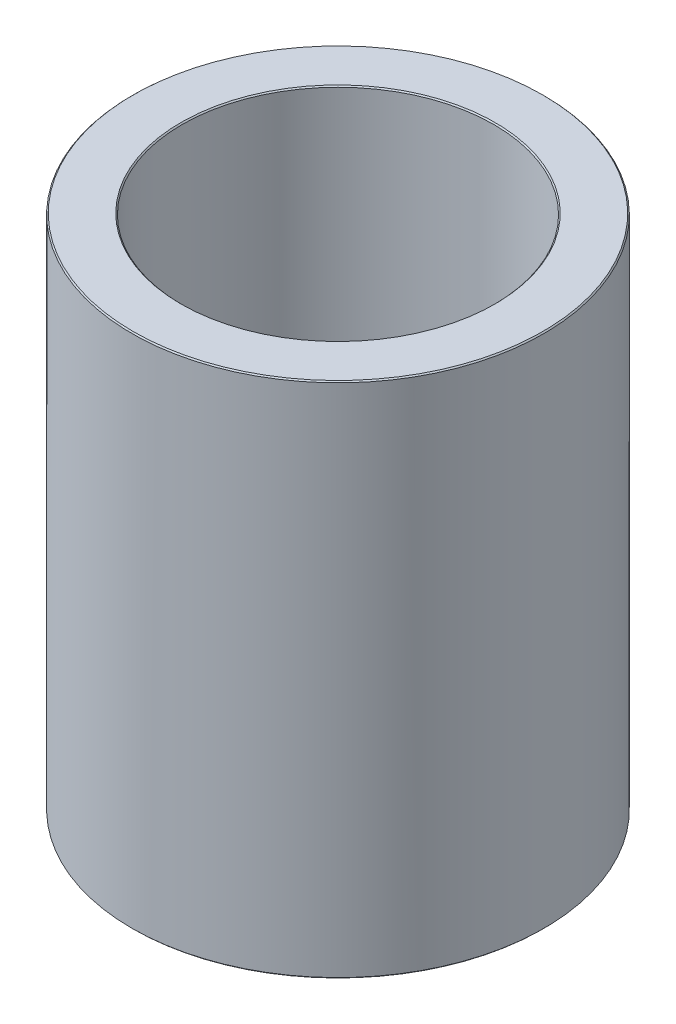
ISO-10303-21;
HEADER;
FILE_DESCRIPTION(('STEP AP214'),'2;1');
FILE_NAME('part.step','',(''),(''),'','','');
FILE_SCHEMA(('AUTOMOTIVE_DESIGN { 1 0 10303 214 1 1 1 1 }'));
ENDSEC;
DATA;
#1=APPLICATION_CONTEXT('core data for automotive mechanical design processes');
#2=APPLICATION_PROTOCOL_DEFINITION('international standard','automotive_design',2000,#1);
#3=PRODUCT_CONTEXT('',#1,'mechanical');
#4=PRODUCT('Part','Part','',(#3));
#5=PRODUCT_RELATED_PRODUCT_CATEGORY('part','',(#4));
#6=PRODUCT_DEFINITION_FORMATION('','',#4);
#7=PRODUCT_DEFINITION_CONTEXT('part definition',#1,'design');
#8=PRODUCT_DEFINITION('design','',#6,#7);
#9=PRODUCT_DEFINITION_SHAPE('','',#8);
#10=(LENGTH_UNIT() NAMED_UNIT(*) SI_UNIT(.MILLI.,.METRE.));
#11=(NAMED_UNIT(*) PLANE_ANGLE_UNIT() SI_UNIT($,.RADIAN.));
#12=(NAMED_UNIT(*) SI_UNIT($,.STERADIAN.) SOLID_ANGLE_UNIT());
#13=UNCERTAINTY_MEASURE_WITH_UNIT(LENGTH_MEASURE(1.E-05),#10,'distance_accuracy_value','');
#14=(GEOMETRIC_REPRESENTATION_CONTEXT(3) GLOBAL_UNCERTAINTY_ASSIGNED_CONTEXT((#13)) GLOBAL_UNIT_ASSIGNED_CONTEXT((#10,
#11,#12)) REPRESENTATION_CONTEXT('',''));
#15=CARTESIAN_POINT('',(0.,0.,0.));
#16=DIRECTION('',(0.,0.,1.));
#17=DIRECTION('',(1.,0.,0.));
#18=AXIS2_PLACEMENT_3D('',#15,#16,#17);
#19=CARTESIAN_POINT('',(0.,113.019225057278,0.));
#20=DIRECTION('',(0.,-1.,0.));
#21=DIRECTION('',(0.,0.,-1.));
#22=AXIS2_PLACEMENT_3D('',#19,#20,#21);
#23=CYLINDRICAL_SURFACE('',#22,45.);
#24=CARTESIAN_POINT('',(0.,0.255956402236898,0.));
#25=DIRECTION('',(0.,1.,0.));
#26=DIRECTION('',(0.,0.,1.));
#27=AXIS2_PLACEMENT_3D('',#24,#25,#26);
#28=CIRCLE('',#27,45.);
#29=CARTESIAN_POINT('',(0.,0.255956402236898,-45.));
#30=VERTEX_POINT('',#29);
#31=EDGE_CURVE('E10',#30,#30,#28,.T.);
#32=CARTESIAN_POINT('',(0.,112.763268655042,0.));
#33=DIRECTION('',(0.,1.,0.));
#34=DIRECTION('',(0.,0.,1.));
#35=AXIS2_PLACEMENT_3D('',#32,#33,#34);
#36=CIRCLE('',#35,45.);
#37=CARTESIAN_POINT('',(0.,112.763268655042,-45.));
#38=VERTEX_POINT('',#37);
#39=EDGE_CURVE('E50',#38,#38,#36,.F.);
#40=CARTESIAN_POINT('',(0.,0.255956402236898,-45.));
#41=CARTESIAN_POINT('',(0.,1.42790757153695,-45.));
#42=CARTESIAN_POINT('',(0.,2.599858740837,-45.));
#43=CARTESIAN_POINT('',(0.,4.9437610794371,-45.));
#44=CARTESIAN_POINT('',(0.,6.11571224873715,-45.));
#45=CARTESIAN_POINT('',(0.,8.45961458733725,-45.));
#46=CARTESIAN_POINT('',(0.,9.6315657566373,-45.));
#47=CARTESIAN_POINT('',(0.,11.9754680952374,-45.));
#48=CARTESIAN_POINT('',(0.,13.1474192645374,-45.));
#49=CARTESIAN_POINT('',(0.,15.4913216031375,-45.));
#50=CARTESIAN_POINT('',(0.,16.6632727724376,-45.));
#51=CARTESIAN_POINT('',(0.,19.0071751110377,-45.));
#52=CARTESIAN_POINT('',(0.,20.1791262803377,-45.));
#53=CARTESIAN_POINT('',(0.,22.5230286189378,-45.));
#54=CARTESIAN_POINT('',(0.,23.6949797882379,-45.));
#55=CARTESIAN_POINT('',(0.,26.038882126838,-45.));
#56=CARTESIAN_POINT('',(0.,27.210833296138,-45.));
#57=CARTESIAN_POINT('',(0.,29.5547356347381,-45.));
#58=CARTESIAN_POINT('',(0.,30.7266868040382,-45.));
#59=CARTESIAN_POINT('',(0.,33.0705891426383,-45.));
#60=CARTESIAN_POINT('',(0.,34.2425403119383,-45.));
#61=CARTESIAN_POINT('',(0.,36.5864426505384,-45.));
#62=CARTESIAN_POINT('',(0.,37.7583938198385,-45.));
#63=CARTESIAN_POINT('',(0.,40.1022961584386,-45.));
#64=CARTESIAN_POINT('',(0.,41.2742473277386,-45.));
#65=CARTESIAN_POINT('',(0.,43.6181496663387,-45.));
#66=CARTESIAN_POINT('',(0.,44.7901008356388,-45.));
#67=CARTESIAN_POINT('',(0.,47.1340031742389,-45.));
#68=CARTESIAN_POINT('',(0.,48.3059543435389,-45.));
#69=CARTESIAN_POINT('',(0.,50.649856682139,-45.));
#70=CARTESIAN_POINT('',(0.,51.8218078514391,-45.));
#71=CARTESIAN_POINT('',(0.,54.1657101900392,-45.));
#72=CARTESIAN_POINT('',(0.,55.3376613593392,-45.));
#73=CARTESIAN_POINT('',(0.,57.6815636979393,-45.));
#74=CARTESIAN_POINT('',(0.,58.8535148672394,-45.));
#75=CARTESIAN_POINT('',(0.,61.1974172058395,-45.));
#76=CARTESIAN_POINT('',(0.,62.3693683751395,-45.));
#77=CARTESIAN_POINT('',(0.,64.7132707137396,-45.));
#78=CARTESIAN_POINT('',(0.,65.8852218830397,-45.));
#79=CARTESIAN_POINT('',(0.,68.2291242216398,-45.));
#80=CARTESIAN_POINT('',(0.,69.4010753909398,-45.));
#81=CARTESIAN_POINT('',(0.,71.7449777295399,-45.));
#82=CARTESIAN_POINT('',(0.,72.91692889884,-45.));
#83=CARTESIAN_POINT('',(0.,75.2608312374401,-45.));
#84=CARTESIAN_POINT('',(0.,76.4327824067401,-45.));
#85=CARTESIAN_POINT('',(0.,78.7766847453402,-45.));
#86=CARTESIAN_POINT('',(0.,79.9486359146403,-45.));
#87=CARTESIAN_POINT('',(0.,82.2925382532404,-45.));
#88=CARTESIAN_POINT('',(0.,83.4644894225404,-45.));
#89=CARTESIAN_POINT('',(0.,85.8083917611405,-45.));
#90=CARTESIAN_POINT('',(0.,86.9803429304406,-45.));
#91=CARTESIAN_POINT('',(0.,89.3242452690407,-45.));
#92=CARTESIAN_POINT('',(0.,90.4961964383407,-45.));
#93=CARTESIAN_POINT('',(0.,92.8400987769408,-45.));
#94=CARTESIAN_POINT('',(0.,94.0120499462409,-45.));
#95=CARTESIAN_POINT('',(0.,96.355952284841,-45.));
#96=CARTESIAN_POINT('',(0.,97.527903454141,-45.));
#97=CARTESIAN_POINT('',(0.,99.8718057927411,-45.));
#98=CARTESIAN_POINT('',(0.,101.043756962041,-45.));
#99=CARTESIAN_POINT('',(0.,103.387659300641,-45.));
#100=CARTESIAN_POINT('',(0.,104.559610469941,-45.));
#101=CARTESIAN_POINT('',(0.,106.903512808541,-45.));
#102=CARTESIAN_POINT('',(0.,108.075463977841,-45.));
#103=CARTESIAN_POINT('',(0.,110.419366316442,-45.));
#104=CARTESIAN_POINT('',(0.,111.591317485742,-45.));
#105=CARTESIAN_POINT('',(0.,112.763268655042,-45.));
#106=B_SPLINE_CURVE_WITH_KNOTS('',3,(#40,#41,#42,#43,#44,#45,#46,#47,#48,#49,#50,#51,#52,#53,
#54,#55,#56,#57,#58,#59,#60,#61,#62,#63,#64,#65,#66,#67,#68,#69,#70,#71,#72,#73,#74,#75,#76,#77,
#78,#79,#80,#81,#82,#83,#84,#85,#86,#87,#88,#89,#90,#91,#92,#93,#94,#95,#96,#97,#98,#99,#100,
#101,#102,#103,#104,#105),.UNSPECIFIED.,.F.,.F.,(4,2,2,2,2,2,2,2,2,2,2,2,2,2,2,2,2,2,2,2,2,2,2,
2,2,2,2,2,2,2,2,2,4),(0.,3.51585350790015,7.0317070158003,10.5475605237004,14.0634140316006,
17.5792675395007,21.0951210474009,24.610974555301,28.1268280632012,31.6426815711013,
35.1585350790015,38.6743885869016,42.1902420948018,45.7060956027019,49.2219491106021,
52.7378026185022,56.2536561264024,59.7695096343025,63.2853631422027,66.8012166501028,
70.317070158003,73.8329236659031,77.3487771738033,80.8646306817034,84.3804841896036,
87.8963376975037,91.4121912054039,94.928044713304,98.4438982212042,101.959751729104,
105.475605237004,108.991458744905,112.507312252805),.UNSPECIFIED.);
#107=EDGE_CURVE('BSEAM39',#30,#38,#106,.T.);
#108=ORIENTED_EDGE('',*,*,#31,.T.);
#109=ORIENTED_EDGE('',*,*,#39,.T.);
#110=ORIENTED_EDGE('',*,*,#107,.T.);
#111=ORIENTED_EDGE('',*,*,#107,.F.);
#112=EDGE_LOOP('',(#108,#110,#109,#111));
#113=FACE_BOUND('',#112,.T.);
#114=ADVANCED_FACE('F39',(#113),#23,.T.);
#115=CARTESIAN_POINT('',(0.,113.019225057278,0.));
#116=DIRECTION('',(0.,1.,0.));
#117=DIRECTION('',(0.,0.,1.));
#118=AXIS2_PLACEMENT_3D('',#115,#116,#117);
#119=PLANE('',#118);
#120=CARTESIAN_POINT('',(0.,113.019225057278,0.));
#121=DIRECTION('',(0.,1.,0.));
#122=DIRECTION('',(0.,0.,1.));
#123=AXIS2_PLACEMENT_3D('',#120,#121,#122);
#124=CIRCLE('',#123,34.323803929552);
#125=CARTESIAN_POINT('',(0.,113.019225057278,34.323803929552));
#126=VERTEX_POINT('',#125);
#127=EDGE_CURVE('E58',#126,#126,#124,.F.);
#128=ORIENTED_EDGE('',*,*,#127,.T.);
#129=EDGE_LOOP('',(#128));
#130=FACE_BOUND('',#129,.T.);
#131=CARTESIAN_POINT('',(0.,113.019225057278,0.));
#132=DIRECTION('',(0.,1.,0.));
#133=DIRECTION('',(0.,0.,1.));
#134=AXIS2_PLACEMENT_3D('',#131,#132,#133);
#135=CIRCLE('',#134,44.7440435977632);
#136=CARTESIAN_POINT('',(0.,113.019225057278,44.7440435977632));
#137=VERTEX_POINT('',#136);
#138=EDGE_CURVE('E61',#137,#137,#135,.T.);
#139=ORIENTED_EDGE('',*,*,#138,.T.);
#140=EDGE_LOOP('',(#139));
#141=FACE_BOUND('',#140,.T.);
#142=ADVANCED_FACE('F88',(#130,#141),#119,.T.);
#143=CARTESIAN_POINT('',(0.,0.,0.));
#144=DIRECTION('',(0.,1.,0.));
#145=DIRECTION('',(0.,0.,1.));
#146=AXIS2_PLACEMENT_3D('',#143,#144,#145);
#147=PLANE('',#146);
#148=CARTESIAN_POINT('',(0.,0.,0.));
#149=DIRECTION('',(0.,1.,0.));
#150=DIRECTION('',(0.,0.,1.));
#151=AXIS2_PLACEMENT_3D('',#148,#149,#150);
#152=CIRCLE('',#151,34.3238039295519);
#153=CARTESIAN_POINT('',(0.,0.,34.3238039295519));
#154=VERTEX_POINT('',#153);
#155=EDGE_CURVE('E51',#154,#154,#152,.T.);
#156=ORIENTED_EDGE('',*,*,#155,.T.);
#157=EDGE_LOOP('',(#156));
#158=FACE_BOUND('',#157,.T.);
#159=CARTESIAN_POINT('',(0.,0.,0.));
#160=DIRECTION('',(0.,1.,0.));
#161=DIRECTION('',(0.,0.,1.));
#162=AXIS2_PLACEMENT_3D('',#159,#160,#161);
#163=CIRCLE('',#162,44.7440435977631);
#164=CARTESIAN_POINT('',(0.,0.,44.7440435977631));
#165=VERTEX_POINT('',#164);
#166=EDGE_CURVE('E54',#165,#165,#163,.F.);
#167=ORIENTED_EDGE('',*,*,#166,.T.);
#168=EDGE_LOOP('',(#167));
#169=FACE_BOUND('',#168,.T.);
#170=ADVANCED_FACE('F83',(#158,#169),#147,.F.);
#171=CARTESIAN_POINT('',(0.,113.019225057278,0.));
#172=DIRECTION('',(0.,-1.,0.));
#173=DIRECTION('',(0.,0.,-1.));
#174=AXIS2_PLACEMENT_3D('',#171,#172,#173);
#175=CYLINDRICAL_SURFACE('',#174,34.067847527315);
#176=CARTESIAN_POINT('',(0.,112.763268655041,0.));
#177=DIRECTION('',(0.,1.,0.));
#178=DIRECTION('',(0.,0.,1.));
#179=AXIS2_PLACEMENT_3D('',#176,#177,#178);
#180=CIRCLE('',#179,34.067847527315);
#181=CARTESIAN_POINT('',(0.,112.763268655041,-34.067847527315));
#182=VERTEX_POINT('',#181);
#183=EDGE_CURVE('E67',#182,#182,#180,.T.);
#184=CARTESIAN_POINT('',(0.,0.255956402236815,0.));
#185=DIRECTION('',(0.,1.,0.));
#186=DIRECTION('',(0.,0.,1.));
#187=AXIS2_PLACEMENT_3D('',#184,#185,#186);
#188=CIRCLE('',#187,34.067847527315);
#189=CARTESIAN_POINT('',(0.,0.255956402236815,-34.067847527315));
#190=VERTEX_POINT('',#189);
#191=EDGE_CURVE('E69',#190,#190,#188,.F.);
#192=CARTESIAN_POINT('',(0.,112.763268655041,-34.067847527315));
#193=CARTESIAN_POINT('',(0.,111.591317485741,-34.067847527315));
#194=CARTESIAN_POINT('',(0.,110.419366316441,-34.067847527315));
#195=CARTESIAN_POINT('',(0.,108.075463977841,-34.067847527315));
#196=CARTESIAN_POINT('',(0.,106.903512808541,-34.067847527315));
#197=CARTESIAN_POINT('',(0.,104.559610469941,-34.067847527315));
#198=CARTESIAN_POINT('',(0.,103.387659300641,-34.067847527315));
#199=CARTESIAN_POINT('',(0.,101.043756962041,-34.067847527315));
#200=CARTESIAN_POINT('',(0.,99.8718057927409,-34.067847527315));
#201=CARTESIAN_POINT('',(0.,97.5279034541408,-34.067847527315));
#202=CARTESIAN_POINT('',(0.,96.3559522848408,-34.067847527315));
#203=CARTESIAN_POINT('',(0.,94.0120499462407,-34.067847527315));
#204=CARTESIAN_POINT('',(0.,92.8400987769406,-34.067847527315));
#205=CARTESIAN_POINT('',(0.,90.4961964383405,-34.067847527315));
#206=CARTESIAN_POINT('',(0.,89.3242452690405,-34.067847527315));
#207=CARTESIAN_POINT('',(0.,86.9803429304404,-34.067847527315));
#208=CARTESIAN_POINT('',(0.,85.8083917611404,-34.067847527315));
#209=CARTESIAN_POINT('',(0.,83.4644894225403,-34.067847527315));
#210=CARTESIAN_POINT('',(0.,82.2925382532402,-34.067847527315));
#211=CARTESIAN_POINT('',(0.,79.9486359146401,-34.067847527315));
#212=CARTESIAN_POINT('',(0.,78.7766847453401,-34.067847527315));
#213=CARTESIAN_POINT('',(0.,76.43278240674,-34.067847527315));
#214=CARTESIAN_POINT('',(0.,75.2608312374399,-34.067847527315));
#215=CARTESIAN_POINT('',(0.,72.9169288988398,-34.067847527315));
#216=CARTESIAN_POINT('',(0.,71.7449777295398,-34.067847527315));
#217=CARTESIAN_POINT('',(0.,69.4010753909397,-34.067847527315));
#218=CARTESIAN_POINT('',(0.,68.2291242216396,-34.067847527315));
#219=CARTESIAN_POINT('',(0.,65.8852218830395,-34.067847527315));
#220=CARTESIAN_POINT('',(0.,64.7132707137395,-34.067847527315));
#221=CARTESIAN_POINT('',(0.,62.3693683751394,-34.067847527315));
#222=CARTESIAN_POINT('',(0.,61.1974172058393,-34.067847527315));
#223=CARTESIAN_POINT('',(0.,58.8535148672392,-34.067847527315));
#224=CARTESIAN_POINT('',(0.,57.6815636979392,-34.067847527315));
#225=CARTESIAN_POINT('',(0.,55.3376613593391,-34.067847527315));
#226=CARTESIAN_POINT('',(0.,54.1657101900391,-34.067847527315));
#227=CARTESIAN_POINT('',(0.,51.821807851439,-34.067847527315));
#228=CARTESIAN_POINT('',(0.,50.6498566821389,-34.067847527315));
#229=CARTESIAN_POINT('',(0.,48.3059543435388,-34.067847527315));
#230=CARTESIAN_POINT('',(0.,47.1340031742388,-34.067847527315));
#231=CARTESIAN_POINT('',(0.,44.7901008356387,-34.067847527315));
#232=CARTESIAN_POINT('',(0.,43.6181496663386,-34.067847527315));
#233=CARTESIAN_POINT('',(0.,41.2742473277385,-34.067847527315));
#234=CARTESIAN_POINT('',(0.,40.1022961584385,-34.067847527315));
#235=CARTESIAN_POINT('',(0.,37.7583938198384,-34.067847527315));
#236=CARTESIAN_POINT('',(0.,36.5864426505383,-34.067847527315));
#237=CARTESIAN_POINT('',(0.,34.2425403119382,-34.067847527315));
#238=CARTESIAN_POINT('',(0.,33.0705891426382,-34.067847527315));
#239=CARTESIAN_POINT('',(0.,30.7266868040381,-34.067847527315));
#240=CARTESIAN_POINT('',(0.,29.554735634738,-34.067847527315));
#241=CARTESIAN_POINT('',(0.,27.2108332961379,-34.067847527315));
#242=CARTESIAN_POINT('',(0.,26.0388821268379,-34.067847527315));
#243=CARTESIAN_POINT('',(0.,23.6949797882378,-34.067847527315));
#244=CARTESIAN_POINT('',(0.,22.5230286189377,-34.067847527315));
#245=CARTESIAN_POINT('',(0.,20.1791262803376,-34.067847527315));
#246=CARTESIAN_POINT('',(0.,19.0071751110376,-34.067847527315));
#247=CARTESIAN_POINT('',(0.,16.6632727724375,-34.067847527315));
#248=CARTESIAN_POINT('',(0.,15.4913216031374,-34.067847527315));
#249=CARTESIAN_POINT('',(0.,13.1474192645374,-34.067847527315));
#250=CARTESIAN_POINT('',(0.,11.9754680952373,-34.067847527315));
#251=CARTESIAN_POINT('',(0.,9.63156575663722,-34.067847527315));
#252=CARTESIAN_POINT('',(0.,8.45961458733717,-34.067847527315));
#253=CARTESIAN_POINT('',(0.,6.11571224873707,-34.067847527315));
#254=CARTESIAN_POINT('',(0.,4.94376107943702,-34.067847527315));
#255=CARTESIAN_POINT('',(0.,2.59985874083692,-34.067847527315));
#256=CARTESIAN_POINT('',(0.,1.42790757153687,-34.067847527315));
#257=CARTESIAN_POINT('',(0.,0.255956402236815,-34.067847527315));
#258=B_SPLINE_CURVE_WITH_KNOTS('',3,(#192,#193,#194,#195,#196,#197,#198,#199,#200,#201,#202,
#203,#204,#205,#206,#207,#208,#209,#210,#211,#212,#213,#214,#215,#216,#217,#218,#219,#220,#221,
#222,#223,#224,#225,#226,#227,#228,#229,#230,#231,#232,#233,#234,#235,#236,#237,#238,#239,#240,
#241,#242,#243,#244,#245,#246,#247,#248,#249,#250,#251,#252,#253,#254,#255,#256,#257),
.UNSPECIFIED.,.F.,.F.,(4,2,2,2,2,2,2,2,2,2,2,2,2,2,2,2,2,2,2,2,2,2,2,2,2,2,2,2,2,2,2,2,4),(0.,
3.51585350790015,7.0317070158003,10.5475605237004,14.0634140316006,17.5792675395007,
21.0951210474009,24.610974555301,28.1268280632012,31.6426815711013,35.1585350790014,
38.6743885869016,42.1902420948018,45.7060956027019,49.221949110602,52.7378026185022,
56.2536561264023,59.7695096343025,63.2853631422026,66.8012166501028,70.3170701580029,
73.8329236659031,77.3487771738032,80.8646306817033,84.3804841896035,87.8963376975036,
91.4121912054038,94.9280447133039,98.4438982212041,101.959751729104,105.475605237004,
108.991458744905,112.507312252805),.UNSPECIFIED.);
#259=EDGE_CURVE('BSEAM71',#182,#190,#258,.T.);
#260=ORIENTED_EDGE('',*,*,#183,.T.);
#261=ORIENTED_EDGE('',*,*,#191,.T.);
#262=ORIENTED_EDGE('',*,*,#259,.T.);
#263=ORIENTED_EDGE('',*,*,#259,.F.);
#264=EDGE_LOOP('',(#260,#262,#261,#263));
#265=FACE_BOUND('',#264,.T.);
#266=ADVANCED_FACE('F71',(#265),#175,.F.);
#267=CARTESIAN_POINT('',(0.,112.763268655041,0.));
#268=DIRECTION('',(0.,1.,0.));
#269=DIRECTION('',(0.,0.,1.));
#270=AXIS2_PLACEMENT_3D('',#267,#268,#269);
#271=CONICAL_SURFACE('',#270,34.067847527315,0.785398163397448);
#272=ORIENTED_EDGE('',*,*,#127,.F.);
#273=EDGE_LOOP('',(#272));
#274=FACE_BOUND('',#273,.T.);
#275=ORIENTED_EDGE('',*,*,#183,.F.);
#276=EDGE_LOOP('',(#275));
#277=FACE_BOUND('',#276,.T.);
#278=ADVANCED_FACE('F77',(#274,#277),#271,.F.);
#279=CARTESIAN_POINT('',(0.,0.,0.));
#280=DIRECTION('',(0.,-1.,0.));
#281=DIRECTION('',(0.,0.,-1.));
#282=AXIS2_PLACEMENT_3D('',#279,#280,#281);
#283=CONICAL_SURFACE('',#282,34.3238039295519,0.785398163397448);
#284=ORIENTED_EDGE('',*,*,#191,.F.);
#285=EDGE_LOOP('',(#284));
#286=FACE_BOUND('',#285,.T.);
#287=ORIENTED_EDGE('',*,*,#155,.F.);
#288=EDGE_LOOP('',(#287));
#289=FACE_BOUND('',#288,.T.);
#290=ADVANCED_FACE('F73',(#286,#289),#283,.F.);
#291=CARTESIAN_POINT('',(0.,0.255956402236898,0.));
#292=DIRECTION('',(0.,1.,0.));
#293=DIRECTION('',(0.,0.,1.));
#294=AXIS2_PLACEMENT_3D('',#291,#292,#293);
#295=CONICAL_SURFACE('',#294,45.,0.785398163397448);
#296=ORIENTED_EDGE('',*,*,#166,.F.);
#297=EDGE_LOOP('',(#296));
#298=FACE_BOUND('',#297,.T.);
#299=ORIENTED_EDGE('',*,*,#31,.F.);
#300=EDGE_LOOP('',(#299));
#301=FACE_BOUND('',#300,.T.);
#302=ADVANCED_FACE('F76',(#298,#301),#295,.T.);
#303=CARTESIAN_POINT('',(0.,113.019225057278,0.));
#304=DIRECTION('',(0.,-1.,0.));
#305=DIRECTION('',(0.,0.,-1.));
#306=AXIS2_PLACEMENT_3D('',#303,#304,#305);
#307=CONICAL_SURFACE('',#306,44.7440435977632,0.785398163397475);
#308=ORIENTED_EDGE('',*,*,#39,.F.);
#309=EDGE_LOOP('',(#308));
#310=FACE_BOUND('',#309,.T.);
#311=ORIENTED_EDGE('',*,*,#138,.F.);
#312=EDGE_LOOP('',(#311));
#313=FACE_BOUND('',#312,.T.);
#314=ADVANCED_FACE('F45',(#310,#313),#307,.T.);
#315=CLOSED_SHELL('',(#114,#142,#170,#266,#278,#290,#302,#314));
#316=MANIFOLD_SOLID_BREP('B2',#315);
#317=ADVANCED_BREP_SHAPE_REPRESENTATION('',(#18,#316),#14);
#318=SHAPE_DEFINITION_REPRESENTATION(#9,#317);
ENDSEC;
END-ISO-10303-21;
